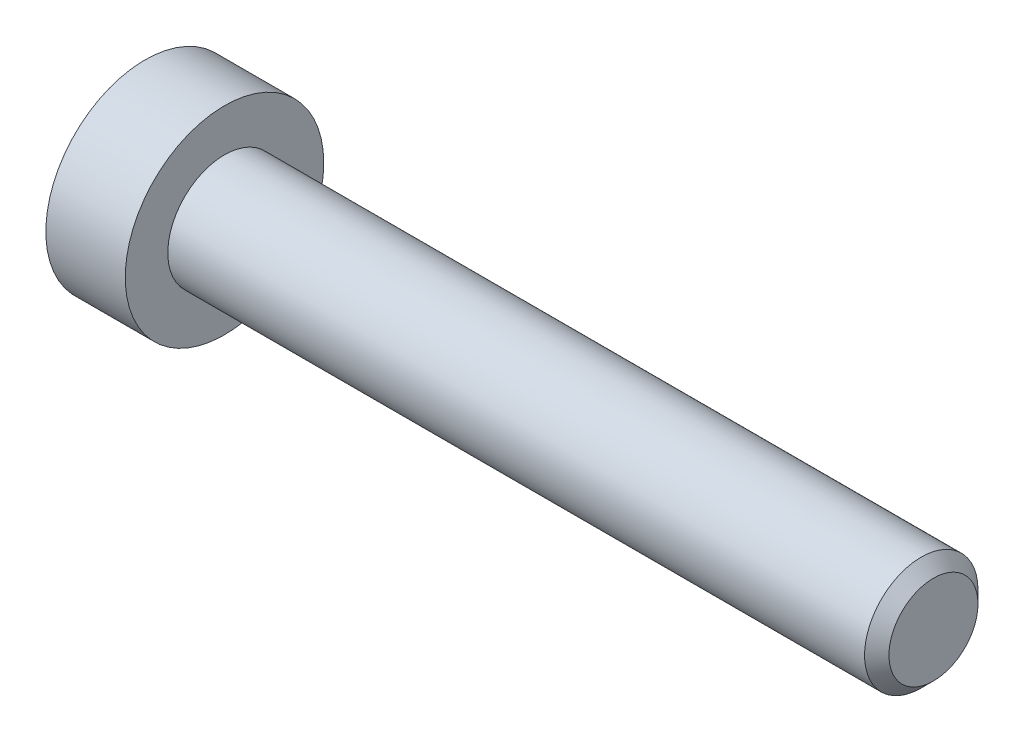
ISO-10303-21;
HEADER;
FILE_DESCRIPTION(('STEP AP214'),'2;1');
FILE_NAME('part.step','',(''),(''),'','','');
FILE_SCHEMA(('AUTOMOTIVE_DESIGN { 1 0 10303 214 1 1 1 1 }'));
ENDSEC;
DATA;
#1=APPLICATION_CONTEXT('core data for automotive mechanical design processes');
#2=APPLICATION_PROTOCOL_DEFINITION('international standard','automotive_design',2000,#1);
#3=PRODUCT_CONTEXT('',#1,'mechanical');
#4=PRODUCT('Part','Part','',(#3));
#5=PRODUCT_RELATED_PRODUCT_CATEGORY('part','',(#4));
#6=PRODUCT_DEFINITION_FORMATION('','',#4);
#7=PRODUCT_DEFINITION_CONTEXT('part definition',#1,'design');
#8=PRODUCT_DEFINITION('design','',#6,#7);
#9=PRODUCT_DEFINITION_SHAPE('','',#8);
#10=(LENGTH_UNIT() NAMED_UNIT(*) SI_UNIT(.MILLI.,.METRE.));
#11=(NAMED_UNIT(*) PLANE_ANGLE_UNIT() SI_UNIT($,.RADIAN.));
#12=(NAMED_UNIT(*) SI_UNIT($,.STERADIAN.) SOLID_ANGLE_UNIT());
#13=UNCERTAINTY_MEASURE_WITH_UNIT(LENGTH_MEASURE(1.E-05),#10,'distance_accuracy_value','');
#14=(GEOMETRIC_REPRESENTATION_CONTEXT(3) GLOBAL_UNCERTAINTY_ASSIGNED_CONTEXT((#13)) GLOBAL_UNIT_ASSIGNED_CONTEXT((#10,
#11,#12)) REPRESENTATION_CONTEXT('',''));
#15=CARTESIAN_POINT('',(0.,0.,0.));
#16=DIRECTION('',(0.,0.,1.));
#17=DIRECTION('',(1.,0.,0.));
#18=AXIS2_PLACEMENT_3D('',#15,#16,#17);
#19=CARTESIAN_POINT('',(-2.8,0.,0.));
#20=DIRECTION('',(1.,0.,0.));
#21=DIRECTION('',(0.,1.,0.));
#22=AXIS2_PLACEMENT_3D('',#19,#20,#21);
#23=PLANE('',#22);
#24=CARTESIAN_POINT('',(-2.8,0.,0.));
#25=DIRECTION('',(1.,0.,0.));
#26=DIRECTION('',(0.,0.,-1.));
#27=AXIS2_PLACEMENT_3D('',#24,#25,#26);
#28=CIRCLE('',#27,3.5);
#29=CARTESIAN_POINT('',(-2.8,0.,-3.5));
#30=VERTEX_POINT('',#29);
#31=EDGE_CURVE('E40',#30,#30,#28,.T.);
#32=ORIENTED_EDGE('',*,*,#31,.F.);
#33=EDGE_LOOP('',(#32));
#34=FACE_BOUND('',#33,.T.);
#35=DIRECTION('',(0.,-1.,0.));
#36=VECTOR('',#35,1.);
#37=CARTESIAN_POINT('',(-2.8,0.866025403784439,1.5));
#38=LINE('',#37,#36);
#39=CARTESIAN_POINT('',(-2.8,0.866025403784439,1.5));
#40=VERTEX_POINT('',#39);
#41=CARTESIAN_POINT('',(-2.8,-0.866025403784439,1.5));
#42=VERTEX_POINT('',#41);
#43=EDGE_CURVE('E11',#40,#42,#38,.T.);
#44=ORIENTED_EDGE('',*,*,#43,.T.);
#45=DIRECTION('',(0.,-0.5,-0.866025403784439));
#46=VECTOR('',#45,1.);
#47=CARTESIAN_POINT('',(-2.8,-0.866025403784439,1.5));
#48=LINE('',#47,#46);
#49=CARTESIAN_POINT('',(-2.8,-1.73205080756888,0.));
#50=VERTEX_POINT('',#49);
#51=EDGE_CURVE('E28',#42,#50,#48,.T.);
#52=ORIENTED_EDGE('',*,*,#51,.T.);
#53=DIRECTION('',(0.,0.5,-0.866025403784439));
#54=VECTOR('',#53,1.);
#55=CARTESIAN_POINT('',(-2.8,-1.73205080756888,0.));
#56=LINE('',#55,#54);
#57=CARTESIAN_POINT('',(-2.8,-0.866025403784439,-1.5));
#58=VERTEX_POINT('',#57);
#59=EDGE_CURVE('E190',#50,#58,#56,.T.);
#60=ORIENTED_EDGE('',*,*,#59,.T.);
#61=DIRECTION('',(0.,1.,0.));
#62=VECTOR('',#61,1.);
#63=CARTESIAN_POINT('',(-2.8,-0.866025403784439,-1.5));
#64=LINE('',#63,#62);
#65=CARTESIAN_POINT('',(-2.8,0.866025403784438,-1.5));
#66=VERTEX_POINT('',#65);
#67=EDGE_CURVE('E147',#58,#66,#64,.T.);
#68=ORIENTED_EDGE('',*,*,#67,.T.);
#69=DIRECTION('',(0.,0.5,0.866025403784439));
#70=VECTOR('',#69,1.);
#71=CARTESIAN_POINT('',(-2.8,0.866025403784439,-1.5));
#72=LINE('',#71,#70);
#73=CARTESIAN_POINT('',(-2.8,1.73205080756888,0.));
#74=VERTEX_POINT('',#73);
#75=EDGE_CURVE('E101',#66,#74,#72,.T.);
#76=ORIENTED_EDGE('',*,*,#75,.T.);
#77=DIRECTION('',(0.,-0.5,0.866025403784439));
#78=VECTOR('',#77,1.);
#79=CARTESIAN_POINT('',(-2.8,1.73205080756888,0.));
#80=LINE('',#79,#78);
#81=EDGE_CURVE('E113',#74,#40,#80,.T.);
#82=ORIENTED_EDGE('',*,*,#81,.T.);
#83=EDGE_LOOP('',(#44,#52,#60,#68,#76,#82));
#84=FACE_BOUND('',#83,.T.);
#85=ADVANCED_FACE('F17',(#34,#84),#23,.F.);
#86=CARTESIAN_POINT('',(-1.32,-0.866025403784439,1.5));
#87=DIRECTION('',(0.,0.866025403784439,-0.5));
#88=DIRECTION('',(-1.,0.,0.));
#89=AXIS2_PLACEMENT_3D('',#86,#87,#88);
#90=PLANE('',#89);
#91=ORIENTED_EDGE('',*,*,#51,.F.);
#92=DIRECTION('',(-1.,0.,0.));
#93=VECTOR('',#92,1.);
#94=CARTESIAN_POINT('',(-1.32,-0.866025403784439,1.5));
#95=LINE('',#94,#93);
#96=CARTESIAN_POINT('',(-1.32,-0.866025403784439,1.5));
#97=VERTEX_POINT('',#96);
#98=EDGE_CURVE('E181',#97,#42,#95,.T.);
#99=ORIENTED_EDGE('',*,*,#98,.F.);
#100=DIRECTION('',(0.,-0.5,-0.866025403784439));
#101=VECTOR('',#100,1.);
#102=CARTESIAN_POINT('',(-1.32,-0.866025403784439,1.5));
#103=LINE('',#102,#101);
#104=CARTESIAN_POINT('',(-1.32,-1.73205080756888,0.));
#105=VERTEX_POINT('',#104);
#106=EDGE_CURVE('E191',#97,#105,#103,.T.);
#107=ORIENTED_EDGE('',*,*,#106,.T.);
#108=DIRECTION('',(-1.,0.,0.));
#109=VECTOR('',#108,1.);
#110=CARTESIAN_POINT('',(-1.32,-1.73205080756888,0.));
#111=LINE('',#110,#109);
#112=EDGE_CURVE('E135',#105,#50,#111,.T.);
#113=ORIENTED_EDGE('',*,*,#112,.T.);
#114=EDGE_LOOP('',(#91,#99,#107,#113));
#115=FACE_BOUND('',#114,.T.);
#116=ADVANCED_FACE('F220',(#115),#90,.T.);
#117=CARTESIAN_POINT('',(-1.32,-1.73205080756888,0.));
#118=DIRECTION('',(0.,0.866025403784439,0.5));
#119=DIRECTION('',(1.,0.,0.));
#120=AXIS2_PLACEMENT_3D('',#117,#118,#119);
#121=PLANE('',#120);
#122=ORIENTED_EDGE('',*,*,#59,.F.);
#123=ORIENTED_EDGE('',*,*,#112,.F.);
#124=DIRECTION('',(0.,0.5,-0.866025403784439));
#125=VECTOR('',#124,1.);
#126=CARTESIAN_POINT('',(-1.32,-1.73205080756888,0.));
#127=LINE('',#126,#125);
#128=CARTESIAN_POINT('',(-1.32,-0.866025403784439,-1.5));
#129=VERTEX_POINT('',#128);
#130=EDGE_CURVE('E150',#105,#129,#127,.T.);
#131=ORIENTED_EDGE('',*,*,#130,.T.);
#132=DIRECTION('',(-1.,0.,0.));
#133=VECTOR('',#132,1.);
#134=CARTESIAN_POINT('',(-1.32,-0.866025403784439,-1.5));
#135=LINE('',#134,#133);
#136=EDGE_CURVE('E142',#129,#58,#135,.T.);
#137=ORIENTED_EDGE('',*,*,#136,.T.);
#138=EDGE_LOOP('',(#122,#123,#131,#137));
#139=FACE_BOUND('',#138,.T.);
#140=ADVANCED_FACE('F154',(#139),#121,.T.);
#141=CARTESIAN_POINT('',(-1.32,0.866025403784439,1.5));
#142=DIRECTION('',(0.,0.,-1.));
#143=DIRECTION('',(0.,-1.,0.));
#144=AXIS2_PLACEMENT_3D('',#141,#142,#143);
#145=PLANE('',#144);
#146=ORIENTED_EDGE('',*,*,#43,.F.);
#147=DIRECTION('',(-1.,0.,0.));
#148=VECTOR('',#147,1.);
#149=CARTESIAN_POINT('',(-1.32,0.866025403784439,1.5));
#150=LINE('',#149,#148);
#151=CARTESIAN_POINT('',(-1.32,0.866025403784439,1.5));
#152=VERTEX_POINT('',#151);
#153=EDGE_CURVE('E186',#152,#40,#150,.T.);
#154=ORIENTED_EDGE('',*,*,#153,.F.);
#155=DIRECTION('',(0.,-1.,0.));
#156=VECTOR('',#155,1.);
#157=CARTESIAN_POINT('',(-1.32,0.866025403784439,1.5));
#158=LINE('',#157,#156);
#159=EDGE_CURVE('E151',#152,#97,#158,.T.);
#160=ORIENTED_EDGE('',*,*,#159,.T.);
#161=ORIENTED_EDGE('',*,*,#98,.T.);
#162=EDGE_LOOP('',(#146,#154,#160,#161));
#163=FACE_BOUND('',#162,.T.);
#164=ADVANCED_FACE('F222',(#163),#145,.T.);
#165=CARTESIAN_POINT('',(25.,1.5705,0.));
#166=DIRECTION('',(-1.,0.,0.));
#167=DIRECTION('',(0.,0.,1.));
#168=AXIS2_PLACEMENT_3D('',#165,#166,#167);
#169=PLANE('',#168);
#170=CARTESIAN_POINT('',(25.,0.,0.));
#171=DIRECTION('',(1.,0.,0.));
#172=DIRECTION('',(0.,0.,-1.));
#173=AXIS2_PLACEMENT_3D('',#170,#171,#172);
#174=CIRCLE('',#173,1.5705);
#175=CARTESIAN_POINT('',(25.,0.,-1.5705));
#176=VERTEX_POINT('',#175);
#177=EDGE_CURVE('E174',#176,#176,#174,.T.);
#178=ORIENTED_EDGE('',*,*,#177,.T.);
#179=EDGE_LOOP('',(#178));
#180=FACE_BOUND('',#179,.T.);
#181=ADVANCED_FACE('F291',(#180),#169,.F.);
#182=CARTESIAN_POINT('',(24.5705,0.,0.));
#183=DIRECTION('',(-1.,0.,0.));
#184=DIRECTION('',(0.,0.,1.));
#185=AXIS2_PLACEMENT_3D('',#182,#183,#184);
#186=CONICAL_SURFACE('',#185,2.,0.785398163397446);
#187=CARTESIAN_POINT('',(24.5705,0.,0.));
#188=DIRECTION('',(1.,0.,0.));
#189=DIRECTION('',(0.,0.,-1.));
#190=AXIS2_PLACEMENT_3D('',#187,#188,#189);
#191=CIRCLE('',#190,2.);
#192=CARTESIAN_POINT('',(24.5705,0.,-2.));
#193=VERTEX_POINT('',#192);
#194=EDGE_CURVE('E21',#193,#193,#191,.T.);
#195=ORIENTED_EDGE('',*,*,#194,.T.);
#196=EDGE_LOOP('',(#195));
#197=FACE_BOUND('',#196,.T.);
#198=ORIENTED_EDGE('',*,*,#177,.F.);
#199=EDGE_LOOP('',(#198));
#200=FACE_BOUND('',#199,.T.);
#201=ADVANCED_FACE('F279',(#197,#200),#186,.T.);
#202=CARTESIAN_POINT('',(25.,0.,0.));
#203=DIRECTION('',(-1.,0.,0.));
#204=DIRECTION('',(0.,0.,-1.));
#205=AXIS2_PLACEMENT_3D('',#202,#203,#204);
#206=CYLINDRICAL_SURFACE('',#205,2.);
#207=CARTESIAN_POINT('',(0.,0.,0.));
#208=DIRECTION('',(1.,0.,0.));
#209=DIRECTION('',(0.,0.,-1.));
#210=AXIS2_PLACEMENT_3D('',#207,#208,#209);
#211=CIRCLE('',#210,2.);
#212=CARTESIAN_POINT('',(0.,0.,-2.));
#213=VERTEX_POINT('',#212);
#214=EDGE_CURVE('E194',#213,#213,#211,.T.);
#215=ORIENTED_EDGE('',*,*,#214,.T.);
#216=EDGE_LOOP('',(#215));
#217=FACE_BOUND('',#216,.T.);
#218=ORIENTED_EDGE('',*,*,#194,.F.);
#219=EDGE_LOOP('',(#218));
#220=FACE_BOUND('',#219,.T.);
#221=ADVANCED_FACE('F274',(#217,#220),#206,.T.);
#222=CARTESIAN_POINT('',(0.,3.5,0.));
#223=DIRECTION('',(-1.,0.,0.));
#224=DIRECTION('',(0.,0.,1.));
#225=AXIS2_PLACEMENT_3D('',#222,#223,#224);
#226=PLANE('',#225);
#227=CARTESIAN_POINT('',(0.,0.,0.));
#228=DIRECTION('',(1.,0.,0.));
#229=DIRECTION('',(0.,0.,-1.));
#230=AXIS2_PLACEMENT_3D('',#227,#228,#229);
#231=CIRCLE('',#230,3.5);
#232=CARTESIAN_POINT('',(0.,0.,-3.5));
#233=VERTEX_POINT('',#232);
#234=EDGE_CURVE('E65',#233,#233,#231,.T.);
#235=ORIENTED_EDGE('',*,*,#234,.T.);
#236=EDGE_LOOP('',(#235));
#237=FACE_BOUND('',#236,.T.);
#238=ORIENTED_EDGE('',*,*,#214,.F.);
#239=EDGE_LOOP('',(#238));
#240=FACE_BOUND('',#239,.T.);
#241=ADVANCED_FACE('F253',(#237,#240),#226,.F.);
#242=CARTESIAN_POINT('',(25.,0.,0.));
#243=DIRECTION('',(-1.,0.,0.));
#244=DIRECTION('',(0.,0.,-1.));
#245=AXIS2_PLACEMENT_3D('',#242,#243,#244);
#246=CYLINDRICAL_SURFACE('',#245,3.5);
#247=ORIENTED_EDGE('',*,*,#31,.T.);
#248=EDGE_LOOP('',(#247));
#249=FACE_BOUND('',#248,.T.);
#250=ORIENTED_EDGE('',*,*,#234,.F.);
#251=EDGE_LOOP('',(#250));
#252=FACE_BOUND('',#251,.T.);
#253=ADVANCED_FACE('F266',(#249,#252),#246,.T.);
#254=CARTESIAN_POINT('',(-1.32,-0.866025403784439,-1.5));
#255=DIRECTION('',(0.,0.,1.));
#256=DIRECTION('',(1.,0.,0.));
#257=AXIS2_PLACEMENT_3D('',#254,#255,#256);
#258=PLANE('',#257);
#259=ORIENTED_EDGE('',*,*,#67,.F.);
#260=ORIENTED_EDGE('',*,*,#136,.F.);
#261=DIRECTION('',(0.,1.,0.));
#262=VECTOR('',#261,1.);
#263=CARTESIAN_POINT('',(-1.32,-0.866025403784439,-1.5));
#264=LINE('',#263,#262);
#265=CARTESIAN_POINT('',(-1.32,0.866025403784438,-1.5));
#266=VERTEX_POINT('',#265);
#267=EDGE_CURVE('E145',#129,#266,#264,.T.);
#268=ORIENTED_EDGE('',*,*,#267,.T.);
#269=DIRECTION('',(-1.,0.,0.));
#270=VECTOR('',#269,1.);
#271=CARTESIAN_POINT('',(-1.32,0.866025403784438,-1.5));
#272=LINE('',#271,#270);
#273=EDGE_CURVE('E80',#266,#66,#272,.T.);
#274=ORIENTED_EDGE('',*,*,#273,.T.);
#275=EDGE_LOOP('',(#259,#260,#268,#274));
#276=FACE_BOUND('',#275,.T.);
#277=ADVANCED_FACE('F143',(#276),#258,.T.);
#278=CARTESIAN_POINT('',(-1.32,0.866025403784439,-1.5));
#279=DIRECTION('',(0.,-0.866025403784439,0.5));
#280=DIRECTION('',(-1.,0.,0.));
#281=AXIS2_PLACEMENT_3D('',#278,#279,#280);
#282=PLANE('',#281);
#283=ORIENTED_EDGE('',*,*,#75,.F.);
#284=ORIENTED_EDGE('',*,*,#273,.F.);
#285=DIRECTION('',(0.,0.5,0.866025403784439));
#286=VECTOR('',#285,1.);
#287=CARTESIAN_POINT('',(-1.32,0.866025403784439,-1.5));
#288=LINE('',#287,#286);
#289=CARTESIAN_POINT('',(-1.32,1.73205080756888,0.));
#290=VERTEX_POINT('',#289);
#291=EDGE_CURVE('E162',#266,#290,#288,.T.);
#292=ORIENTED_EDGE('',*,*,#291,.T.);
#293=DIRECTION('',(-1.,0.,0.));
#294=VECTOR('',#293,1.);
#295=CARTESIAN_POINT('',(-1.32,1.73205080756888,0.));
#296=LINE('',#295,#294);
#297=EDGE_CURVE('E177',#290,#74,#296,.T.);
#298=ORIENTED_EDGE('',*,*,#297,.T.);
#299=EDGE_LOOP('',(#283,#284,#292,#298));
#300=FACE_BOUND('',#299,.T.);
#301=ADVANCED_FACE('F257',(#300),#282,.T.);
#302=CARTESIAN_POINT('',(-1.32,1.73205080756888,0.));
#303=DIRECTION('',(0.,-0.866025403784439,-0.5));
#304=DIRECTION('',(0.,0.5,-0.866025403784439));
#305=AXIS2_PLACEMENT_3D('',#302,#303,#304);
#306=PLANE('',#305);
#307=ORIENTED_EDGE('',*,*,#81,.F.);
#308=ORIENTED_EDGE('',*,*,#297,.F.);
#309=DIRECTION('',(0.,-0.5,0.866025403784439));
#310=VECTOR('',#309,1.);
#311=CARTESIAN_POINT('',(-1.32,1.73205080756888,0.));
#312=LINE('',#311,#310);
#313=EDGE_CURVE('E209',#290,#152,#312,.T.);
#314=ORIENTED_EDGE('',*,*,#313,.T.);
#315=ORIENTED_EDGE('',*,*,#153,.T.);
#316=EDGE_LOOP('',(#307,#308,#314,#315));
#317=FACE_BOUND('',#316,.T.);
#318=ADVANCED_FACE('F255',(#317),#306,.T.);
#319=CARTESIAN_POINT('',(-1.32,0.,0.));
#320=DIRECTION('',(1.,0.,0.));
#321=DIRECTION('',(0.,1.,0.));
#322=AXIS2_PLACEMENT_3D('',#319,#320,#321);
#323=PLANE('',#322);
#324=ORIENTED_EDGE('',*,*,#159,.F.);
#325=ORIENTED_EDGE('',*,*,#313,.F.);
#326=ORIENTED_EDGE('',*,*,#291,.F.);
#327=ORIENTED_EDGE('',*,*,#267,.F.);
#328=ORIENTED_EDGE('',*,*,#130,.F.);
#329=ORIENTED_EDGE('',*,*,#106,.F.);
#330=EDGE_LOOP('',(#324,#325,#326,#327,#328,#329));
#331=FACE_BOUND('',#330,.T.);
#332=CARTESIAN_POINT('',(-1.32,0.,0.));
#333=DIRECTION('',(-1.,0.,0.));
#334=DIRECTION('',(0.,0.,-1.));
#335=AXIS2_PLACEMENT_3D('',#332,#333,#334);
#336=CIRCLE('',#335,1.);
#337=CARTESIAN_POINT('',(-1.32,0.,-1.));
#338=VERTEX_POINT('',#337);
#339=EDGE_CURVE('E182',#338,#338,#336,.T.);
#340=ORIENTED_EDGE('',*,*,#339,.F.);
#341=EDGE_LOOP('',(#340));
#342=FACE_BOUND('',#341,.T.);
#343=ADVANCED_FACE('F19',(#331,#342),#323,.F.);
#344=CARTESIAN_POINT('',(1.07735026918963,0.,0.));
#345=DIRECTION('',(-1.,0.,0.));
#346=DIRECTION('',(0.,0.,-1.));
#347=AXIS2_PLACEMENT_3D('',#344,#345,#346);
#348=CYLINDRICAL_SURFACE('',#347,1.);
#349=ORIENTED_EDGE('',*,*,#339,.T.);
#350=EDGE_LOOP('',(#349));
#351=FACE_BOUND('',#350,.T.);
#352=CARTESIAN_POINT('',(0.5,0.,0.));
#353=DIRECTION('',(1.,0.,0.));
#354=DIRECTION('',(0.,0.,-1.));
#355=AXIS2_PLACEMENT_3D('',#352,#353,#354);
#356=CIRCLE('',#355,1.);
#357=CARTESIAN_POINT('',(0.5,0.,-1.));
#358=VERTEX_POINT('',#357);
#359=EDGE_CURVE('E187',#358,#358,#356,.T.);
#360=ORIENTED_EDGE('',*,*,#359,.T.);
#361=EDGE_LOOP('',(#360));
#362=FACE_BOUND('',#361,.T.);
#363=ADVANCED_FACE('F233',(#351,#362),#348,.F.);
#364=CARTESIAN_POINT('',(0.5,0.,0.));
#365=DIRECTION('',(-1.,0.,0.));
#366=DIRECTION('',(0.,0.,1.));
#367=AXIS2_PLACEMENT_3D('',#364,#365,#366);
#368=CONICAL_SURFACE('',#367,1.,1.0471975511966);
#369=ORIENTED_EDGE('',*,*,#359,.F.);
#370=EDGE_LOOP('',(#369));
#371=FACE_BOUND('',#370,.T.);
#372=CARTESIAN_POINT('',(1.07735026918963,0.,0.));
#373=VERTEX_POINT('',#372);
#374=VERTEX_LOOP('',#373);
#375=FACE_BOUND('',#374,.T.);
#376=ADVANCED_FACE('F235',(#371,#375),#368,.F.);
#377=CLOSED_SHELL('',(#85,#116,#140,#164,#181,#201,#221,#241,#253,#277,#301,#318,#343,#363,#376));
#378=MANIFOLD_SOLID_BREP('B1',#377);
#379=ADVANCED_BREP_SHAPE_REPRESENTATION('',(#18,#378),#14);
#380=SHAPE_DEFINITION_REPRESENTATION(#9,#379);
ENDSEC;
END-ISO-10303-21;
